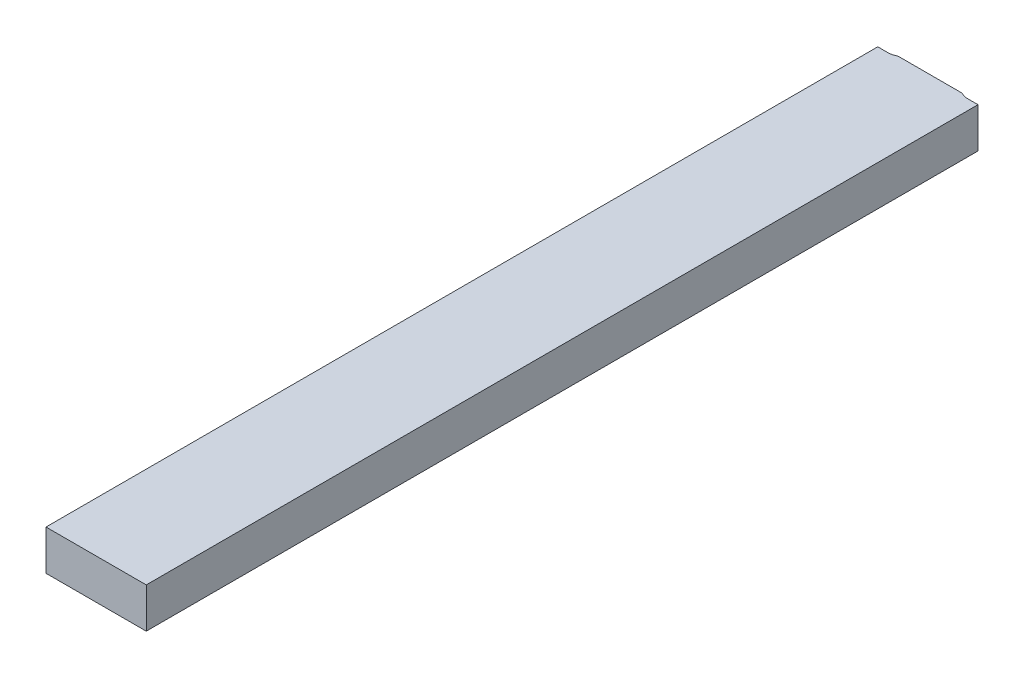
ISO-10303-21;
HEADER;
FILE_DESCRIPTION(('STEP AP214'),'2;1');
FILE_NAME('part.step','',(''),(''),'','','');
FILE_SCHEMA(('AUTOMOTIVE_DESIGN { 1 0 10303 214 1 1 1 1 }'));
ENDSEC;
DATA;
#1=APPLICATION_CONTEXT('core data for automotive mechanical design processes');
#2=APPLICATION_PROTOCOL_DEFINITION('international standard','automotive_design',2000,#1);
#3=PRODUCT_CONTEXT('',#1,'mechanical');
#4=PRODUCT('Part','Part','',(#3));
#5=PRODUCT_RELATED_PRODUCT_CATEGORY('part','',(#4));
#6=PRODUCT_DEFINITION_FORMATION('','',#4);
#7=PRODUCT_DEFINITION_CONTEXT('part definition',#1,'design');
#8=PRODUCT_DEFINITION('design','',#6,#7);
#9=PRODUCT_DEFINITION_SHAPE('','',#8);
#10=(LENGTH_UNIT() NAMED_UNIT(*) SI_UNIT(.MILLI.,.METRE.));
#11=(NAMED_UNIT(*) PLANE_ANGLE_UNIT() SI_UNIT($,.RADIAN.));
#12=(NAMED_UNIT(*) SI_UNIT($,.STERADIAN.) SOLID_ANGLE_UNIT());
#13=UNCERTAINTY_MEASURE_WITH_UNIT(LENGTH_MEASURE(1.E-05),#10,'distance_accuracy_value','');
#14=(GEOMETRIC_REPRESENTATION_CONTEXT(3) GLOBAL_UNCERTAINTY_ASSIGNED_CONTEXT((#13)) GLOBAL_UNIT_ASSIGNED_CONTEXT((#10,
#11,#12)) REPRESENTATION_CONTEXT('',''));
#15=CARTESIAN_POINT('',(0.,0.,0.));
#16=DIRECTION('',(0.,0.,1.));
#17=DIRECTION('',(1.,0.,0.));
#18=AXIS2_PLACEMENT_3D('',#15,#16,#17);
#19=CARTESIAN_POINT('',(-4.5,0.275,-4.982138483571));
#20=DIRECTION('',(0.,1.,0.));
#21=DIRECTION('',(0.,0.,1.));
#22=AXIS2_PLACEMENT_3D('',#19,#20,#21);
#23=PLANE('',#22);
#24=DIRECTION('',(1.,0.,0.));
#25=VECTOR('',#24,1.);
#26=CARTESIAN_POINT('',(-4.725,0.275,-7.051158663985));
#27=LINE('',#26,#25);
#28=CARTESIAN_POINT('',(-4.75,0.275,-7.051158663985));
#29=VERTEX_POINT('',#28);
#30=CARTESIAN_POINT('',(-4.69999999999826,0.275,-7.05115866398515));
#31=VERTEX_POINT('',#30);
#32=EDGE_CURVE('E184',#29,#31,#27,.T.);
#33=ORIENTED_EDGE('',*,*,#32,.T.);
#34=CARTESIAN_POINT('',(-4.66074390617903,0.275,-7.06145062487903));
#35=CARTESIAN_POINT('',(-4.66430562065387,0.275,-7.05943829430754));
#36=CARTESIAN_POINT('',(-4.66802308541288,0.275,-7.05770911016996));
#37=CARTESIAN_POINT('',(-4.67567866839801,0.275,-7.05483826908998));
#38=CARTESIAN_POINT('',(-4.67961678669287,0.275,-7.05369661233063));
#39=CARTESIAN_POINT('',(-4.68899940611309,0.275,-7.05173413514556));
#40=CARTESIAN_POINT('',(-4.6944962200161,0.275,-7.05115865434742));
#41=CARTESIAN_POINT('',(-4.69999999999652,0.275,-7.0511586639853));
#42=B_SPLINE_CURVE_WITH_KNOTS('',3,(#34,#35,#36,#37,#38,#39,#40,#41),.UNSPECIFIED.,.F.,.F.,(4,2,
2,4),(0.,0.0122542009828675,0.0245084057837986,0.0409766482847954),.UNSPECIFIED.);
#43=CARTESIAN_POINT('',(-4.66074390617903,0.275,-7.06145062487903));
#44=VERTEX_POINT('',#43);
#45=EDGE_CURVE('E93',#44,#31,#42,.T.);
#46=ORIENTED_EDGE('',*,*,#45,.F.);
#47=DIRECTION('',(1.,0.,0.));
#48=VECTOR('',#47,1.);
#49=CARTESIAN_POINT('',(-4.499999951796,0.275,-7.061450624879));
#50=LINE('',#49,#48);
#51=CARTESIAN_POINT('',(-4.339255997412,0.275,-7.06145062487899));
#52=VERTEX_POINT('',#51);
#53=EDGE_CURVE('E89',#44,#52,#50,.T.);
#54=ORIENTED_EDGE('',*,*,#53,.T.);
#55=CARTESIAN_POINT('',(-4.30000000000351,0.275,-7.05115866398509));
#56=CARTESIAN_POINT('',(-4.30408879277278,0.275,-7.05116284562048));
#57=CARTESIAN_POINT('',(-4.30817611333355,0.275,-7.05148113218099));
#58=CARTESIAN_POINT('',(-4.31625667415824,0.275,-7.05273057454798));
#59=CARTESIAN_POINT('',(-4.32024989952298,0.275,-7.05366182674584));
#60=CARTESIAN_POINT('',(-4.32939082766555,0.275,-7.05654480111922));
#61=CARTESIAN_POINT('',(-4.33446335028937,0.275,-7.05873731135742));
#62=CARTESIAN_POINT('',(-4.339255997412,0.275,-7.06145062487899));
#63=B_SPLINE_CURVE_WITH_KNOTS('',3,(#55,#56,#57,#58,#59,#60,#61,#62),.UNSPECIFIED.,.F.,.F.,(4,2,
2,4),(0.,0.0122527379750495,0.0245074032044925,0.0409759652394023),.UNSPECIFIED.);
#64=CARTESIAN_POINT('',(-4.30000000000175,0.275,-7.05115866398507));
#65=VERTEX_POINT('',#64);
#66=EDGE_CURVE('E21',#65,#52,#63,.T.);
#67=ORIENTED_EDGE('',*,*,#66,.F.);
#68=DIRECTION('',(1.,0.,0.));
#69=VECTOR('',#68,1.);
#70=CARTESIAN_POINT('',(-4.275,0.275,-7.051158663985));
#71=LINE('',#70,#69);
#72=CARTESIAN_POINT('',(-4.25,0.275,-7.051158663985));
#73=VERTEX_POINT('',#72);
#74=EDGE_CURVE('E84',#65,#73,#71,.T.);
#75=ORIENTED_EDGE('',*,*,#74,.T.);
#76=DIRECTION('',(0.,0.,-1.));
#77=VECTOR('',#76,1.);
#78=CARTESIAN_POINT('',(-4.25,0.275,-4.976992503125));
#79=LINE('',#78,#77);
#80=CARTESIAN_POINT('',(-4.25,0.275,-2.902826342264));
#81=VERTEX_POINT('',#80);
#82=EDGE_CURVE('E218',#81,#73,#79,.T.);
#83=ORIENTED_EDGE('',*,*,#82,.F.);
#84=DIRECTION('',(1.,0.,0.));
#85=VECTOR('',#84,1.);
#86=CARTESIAN_POINT('',(-4.5,0.275,-2.902826342264));
#87=LINE('',#86,#85);
#88=CARTESIAN_POINT('',(-4.75,0.275,-2.902826342264));
#89=VERTEX_POINT('',#88);
#90=EDGE_CURVE('E204',#89,#81,#87,.T.);
#91=ORIENTED_EDGE('',*,*,#90,.F.);
#92=DIRECTION('',(0.,0.,-1.));
#93=VECTOR('',#92,1.);
#94=CARTESIAN_POINT('',(-4.75,0.275,-4.976992503125));
#95=LINE('',#94,#93);
#96=EDGE_CURVE('E176',#89,#29,#95,.T.);
#97=ORIENTED_EDGE('',*,*,#96,.T.);
#98=EDGE_LOOP('',(#33,#46,#54,#67,#75,#83,#91,#97));
#99=FACE_BOUND('',#98,.T.);
#100=ADVANCED_FACE('F17',(#99),#23,.F.);
#101=CARTESIAN_POINT('',(-4.25,0.375,-4.976992503125));
#102=DIRECTION('',(1.,0.,0.));
#103=DIRECTION('',(0.,0.,-1.));
#104=AXIS2_PLACEMENT_3D('',#101,#102,#103);
#105=PLANE('',#104);
#106=DIRECTION('',(0.,0.,1.));
#107=VECTOR('',#106,1.);
#108=CARTESIAN_POINT('',(-4.25,0.475,-4.982138483571));
#109=LINE('',#108,#107);
#110=CARTESIAN_POINT('',(-4.25,0.475,-2.902826342264));
#111=VERTEX_POINT('',#110);
#112=CARTESIAN_POINT('',(-4.25,0.475,-7.051158663985));
#113=VERTEX_POINT('',#112);
#114=EDGE_CURVE('E189',#111,#113,#109,.F.);
#115=ORIENTED_EDGE('',*,*,#114,.F.);
#116=DIRECTION('',(0.,1.,0.));
#117=VECTOR('',#116,1.);
#118=CARTESIAN_POINT('',(-4.25,0.375,-2.902826342264));
#119=LINE('',#118,#117);
#120=EDGE_CURVE('E203',#81,#111,#119,.T.);
#121=ORIENTED_EDGE('',*,*,#120,.F.);
#122=ORIENTED_EDGE('',*,*,#82,.T.);
#123=DIRECTION('',(0.,1.,0.));
#124=VECTOR('',#123,1.);
#125=CARTESIAN_POINT('',(-4.25,0.375,-7.051158663985));
#126=LINE('',#125,#124);
#127=EDGE_CURVE('E233',#73,#113,#126,.T.);
#128=ORIENTED_EDGE('',*,*,#127,.T.);
#129=EDGE_LOOP('',(#115,#121,#122,#128));
#130=FACE_BOUND('',#129,.T.);
#131=ADVANCED_FACE('F238',(#130),#105,.T.);
#132=CARTESIAN_POINT('',(-4.275,0.375,-7.051158663985));
#133=DIRECTION('',(0.,0.,1.));
#134=DIRECTION('',(1.,0.,0.));
#135=AXIS2_PLACEMENT_3D('',#132,#133,#134);
#136=PLANE('',#135);
#137=DIRECTION('',(1.,0.,0.));
#138=VECTOR('',#137,1.);
#139=CARTESIAN_POINT('',(-4.5,0.475,-7.051158663985));
#140=LINE('',#139,#138);
#141=CARTESIAN_POINT('',(-4.30000007335933,0.475,-7.05115866418436));
#142=VERTEX_POINT('',#141);
#143=EDGE_CURVE('E135',#113,#142,#140,.F.);
#144=ORIENTED_EDGE('',*,*,#143,.F.);
#145=ORIENTED_EDGE('',*,*,#127,.F.);
#146=ORIENTED_EDGE('',*,*,#74,.F.);
#147=DIRECTION('',(0.,1.,0.));
#148=VECTOR('',#147,1.);
#149=CARTESIAN_POINT('',(-4.3,0.2699679840491,-7.05115866398508));
#150=LINE('',#149,#148);
#151=EDGE_CURVE('E103',#142,#65,#150,.F.);
#152=ORIENTED_EDGE('',*,*,#151,.F.);
#153=EDGE_LOOP('',(#144,#145,#146,#152));
#154=FACE_BOUND('',#153,.T.);
#155=ADVANCED_FACE('F125',(#154),#136,.F.);
#156=CARTESIAN_POINT('',(-4.29748039058,0.2699679840491,-7.051190309039));
#157=CARTESIAN_POINT('',(-4.29831958238,0.2699679840491,-7.051166943388));
#158=CARTESIAN_POINT('',(-4.304384997637,0.2699679840491,-7.051090682037));
#159=CARTESIAN_POINT('',(-4.315708586206,0.2699679840491,-7.052195104335));
#160=CARTESIAN_POINT('',(-4.328858649665,0.2699679840491,-7.056177217872));
#161=CARTESIAN_POINT('',(-4.337975877851,0.2699679840491,-7.060613467733));
#162=CARTESIAN_POINT('',(-4.342157497933,0.2699679840491,-7.063145821386));
#163=CARTESIAN_POINT('',(-4.343566222697,0.2699679840491,-7.064061090588));
#164=(BOUNDED_CURVE() B_SPLINE_CURVE(3,(#156,#157,#158,#159,#160,#161,#162,#163),.UNSPECIFIED.,
.F.,.F.) B_SPLINE_CURVE_WITH_KNOTS((4,1,1,1,1,4),(0.,0.05196482602246,0.3752098129395,
0.6983604955075,0.8962889073999,1.),
.UNSPECIFIED.) CURVE() GEOMETRIC_REPRESENTATION_ITEM() RATIONAL_B_SPLINE_CURVE((1.,1.,1.,1.,1.,
1.,1.,1.)) REPRESENTATION_ITEM(''));
#165=DIRECTION('',(0.,1.,0.));
#166=VECTOR('',#165,1.);
#167=SURFACE_OF_LINEAR_EXTRUSION('',#164,#166);
#168=ORIENTED_EDGE('',*,*,#66,.T.);
#169=DIRECTION('',(0.,1.,0.));
#170=VECTOR('',#169,1.);
#171=CARTESIAN_POINT('',(-4.339255997412,0.375,-7.061450624879));
#172=LINE('',#171,#170);
#173=CARTESIAN_POINT('',(-4.339255997412,0.475,-7.061450624879));
#174=VERTEX_POINT('',#173);
#175=EDGE_CURVE('E97',#52,#174,#172,.T.);
#176=ORIENTED_EDGE('',*,*,#175,.T.);
#177=CARTESIAN_POINT('',(-4.30000014671866,0.475,-7.05115866438369));
#178=CARTESIAN_POINT('',(-4.30408893948173,0.475,-7.0511628532203));
#179=CARTESIAN_POINT('',(-4.30817625948792,0.475,-7.05148114713333));
#180=CARTESIAN_POINT('',(-4.31625681806449,0.475,-7.05273060421157));
#181=CARTESIAN_POINT('',(-4.3202500417355,0.475,-7.05366186376829));
#182=CARTESIAN_POINT('',(-4.32939091806165,0.475,-7.05654484039364));
#183=CARTESIAN_POINT('',(-4.33446339307278,0.475,-7.05873733584115));
#184=CARTESIAN_POINT('',(-4.339255997412,0.475,-7.06145062487899));
#185=B_SPLINE_CURVE_WITH_KNOTS('',3,(#177,#178,#179,#180,#181,#182,#183,#184),.UNSPECIFIED.,.F.,
.F.,(4,2,2,4),(0.,0.0122527379884832,0.0245074032339859,0.0409758193004646),.UNSPECIFIED.);
#186=EDGE_CURVE('E129',#142,#174,#185,.T.);
#187=ORIENTED_EDGE('',*,*,#186,.F.);
#188=ORIENTED_EDGE('',*,*,#151,.T.);
#189=EDGE_LOOP('',(#168,#176,#187,#188));
#190=FACE_BOUND('',#189,.T.);
#191=ADVANCED_FACE('F100',(#190),#167,.T.);
#192=CARTESIAN_POINT('',(-4.499999951796,0.375,-7.061450624879));
#193=DIRECTION('',(0.,0.,1.));
#194=DIRECTION('',(1.,0.,0.));
#195=AXIS2_PLACEMENT_3D('',#192,#193,#194);
#196=PLANE('',#195);
#197=ORIENTED_EDGE('',*,*,#53,.F.);
#198=DIRECTION('',(0.,1.,0.));
#199=VECTOR('',#198,1.);
#200=CARTESIAN_POINT('',(-4.66074390617902,0.2699679840491,-7.06145062487904));
#201=LINE('',#200,#199);
#202=CARTESIAN_POINT('',(-4.66074390617902,0.475,-7.06145062487903));
#203=VERTEX_POINT('',#202);
#204=EDGE_CURVE('E109',#203,#44,#201,.F.);
#205=ORIENTED_EDGE('',*,*,#204,.F.);
#206=DIRECTION('',(1.,0.,0.));
#207=VECTOR('',#206,1.);
#208=CARTESIAN_POINT('',(-4.5,0.475,-7.061450624879));
#209=LINE('',#208,#207);
#210=EDGE_CURVE('E106',#174,#203,#209,.F.);
#211=ORIENTED_EDGE('',*,*,#210,.F.);
#212=ORIENTED_EDGE('',*,*,#175,.F.);
#213=EDGE_LOOP('',(#197,#205,#211,#212));
#214=FACE_BOUND('',#213,.T.);
#215=ADVANCED_FACE('F104',(#214),#196,.F.);
#216=CARTESIAN_POINT('',(-4.656433692458,0.2699679840491,-7.064061118802));
#217=CARTESIAN_POINT('',(-4.65784241379,0.2699679840491,-7.063145841608));
#218=CARTESIAN_POINT('',(-4.662021892669,0.2699679840491,-7.060614746012));
#219=CARTESIAN_POINT('',(-4.67113801512,0.2699679840491,-7.056178456814));
#220=CARTESIAN_POINT('',(-4.684287959398,0.2699679840491,-7.052195755785));
#221=CARTESIAN_POINT('',(-4.695613253729,0.2699679840491,-7.051090694486));
#222=CARTESIAN_POINT('',(-4.701678868218,0.2699679840491,-7.051166937919));
#223=CARTESIAN_POINT('',(-4.702517288364,0.2699679840491,-7.051190272618));
#224=(BOUNDED_CURVE() B_SPLINE_CURVE(3,(#216,#217,#218,#219,#220,#221,#222,#223),.UNSPECIFIED.,
.F.,.F.) B_SPLINE_CURVE_WITH_KNOTS((4,1,1,1,1,4),(0.,0.1037158878781,0.3014998794713,
0.6247605212749,0.9480806664175,1.),
.UNSPECIFIED.) CURVE() GEOMETRIC_REPRESENTATION_ITEM() RATIONAL_B_SPLINE_CURVE((1.,1.,1.,1.,1.,
1.,1.,1.)) REPRESENTATION_ITEM(''));
#225=DIRECTION('',(0.,1.,0.));
#226=VECTOR('',#225,1.);
#227=SURFACE_OF_LINEAR_EXTRUSION('',#224,#226);
#228=CARTESIAN_POINT('',(-4.66074390617903,0.475,-7.06145062487904));
#229=CARTESIAN_POINT('',(-4.66430562063098,0.475,-7.05943829433274));
#230=CARTESIAN_POINT('',(-4.66802308540143,0.475,-7.05770911018256));
#231=CARTESIAN_POINT('',(-4.67567866840944,0.475,-7.05483826907738));
#232=CARTESIAN_POINT('',(-4.67961678671575,0.475,-7.05369661230543));
#233=CARTESIAN_POINT('',(-4.68899935836829,0.475,-7.05173414515934));
#234=CARTESIAN_POINT('',(-4.69449612238526,0.475,-7.05115866469184));
#235=CARTESIAN_POINT('',(-4.69999985318857,0.475,-7.05115866438328));
#236=B_SPLINE_CURVE_WITH_KNOTS('',3,(#228,#229,#230,#231,#232,#233,#234,#235),.UNSPECIFIED.,.F.,
.F.,(4,2,2,4),(0.,0.0122542009828683,0.0245084057837985,0.0409765022206852),.UNSPECIFIED.);
#237=CARTESIAN_POINT('',(-4.7,0.475,-7.051158663985));
#238=VERTEX_POINT('',#237);
#239=EDGE_CURVE('E136',#203,#238,#236,.T.);
#240=ORIENTED_EDGE('',*,*,#239,.F.);
#241=ORIENTED_EDGE('',*,*,#204,.T.);
#242=ORIENTED_EDGE('',*,*,#45,.T.);
#243=DIRECTION('',(0.,1.,0.));
#244=VECTOR('',#243,1.);
#245=CARTESIAN_POINT('',(-4.7,0.375,-7.051158663985));
#246=LINE('',#245,#244);
#247=EDGE_CURVE('E182',#31,#238,#246,.T.);
#248=ORIENTED_EDGE('',*,*,#247,.T.);
#249=EDGE_LOOP('',(#240,#241,#242,#248));
#250=FACE_BOUND('',#249,.T.);
#251=ADVANCED_FACE('F159',(#250),#227,.T.);
#252=CARTESIAN_POINT('',(-4.725,0.375,-7.051158663985));
#253=DIRECTION('',(0.,0.,1.));
#254=DIRECTION('',(1.,0.,0.));
#255=AXIS2_PLACEMENT_3D('',#252,#253,#254);
#256=PLANE('',#255);
#257=DIRECTION('',(1.,0.,0.));
#258=VECTOR('',#257,1.);
#259=CARTESIAN_POINT('',(-4.5,0.475,-7.051158663985));
#260=LINE('',#259,#258);
#261=CARTESIAN_POINT('',(-4.75,0.475,-7.051158663985));
#262=VERTEX_POINT('',#261);
#263=EDGE_CURVE('E181',#238,#262,#260,.F.);
#264=ORIENTED_EDGE('',*,*,#263,.F.);
#265=ORIENTED_EDGE('',*,*,#247,.F.);
#266=ORIENTED_EDGE('',*,*,#32,.F.);
#267=DIRECTION('',(0.,1.,0.));
#268=VECTOR('',#267,1.);
#269=CARTESIAN_POINT('',(-4.75,0.375,-7.051158663985));
#270=LINE('',#269,#268);
#271=EDGE_CURVE('E174',#29,#262,#270,.T.);
#272=ORIENTED_EDGE('',*,*,#271,.T.);
#273=EDGE_LOOP('',(#264,#265,#266,#272));
#274=FACE_BOUND('',#273,.T.);
#275=ADVANCED_FACE('F157',(#274),#256,.F.);
#276=CARTESIAN_POINT('',(-4.75,0.375,-4.976992503125));
#277=DIRECTION('',(1.,0.,0.));
#278=DIRECTION('',(0.,0.,-1.));
#279=AXIS2_PLACEMENT_3D('',#276,#277,#278);
#280=PLANE('',#279);
#281=ORIENTED_EDGE('',*,*,#271,.F.);
#282=ORIENTED_EDGE('',*,*,#96,.F.);
#283=DIRECTION('',(0.,1.,0.));
#284=VECTOR('',#283,1.);
#285=CARTESIAN_POINT('',(-4.75,0.375,-2.902826342264));
#286=LINE('',#285,#284);
#287=CARTESIAN_POINT('',(-4.75,0.475,-2.902826342264));
#288=VERTEX_POINT('',#287);
#289=EDGE_CURVE('E40',#288,#89,#286,.F.);
#290=ORIENTED_EDGE('',*,*,#289,.F.);
#291=DIRECTION('',(0.,0.,1.));
#292=VECTOR('',#291,1.);
#293=CARTESIAN_POINT('',(-4.75,0.475,-4.982138483571));
#294=LINE('',#293,#292);
#295=EDGE_CURVE('E31',#262,#288,#294,.T.);
#296=ORIENTED_EDGE('',*,*,#295,.F.);
#297=EDGE_LOOP('',(#281,#282,#290,#296));
#298=FACE_BOUND('',#297,.T.);
#299=ADVANCED_FACE('F153',(#298),#280,.F.);
#300=CARTESIAN_POINT('',(-4.5,0.375,-2.902826342264));
#301=DIRECTION('',(0.,0.,1.));
#302=DIRECTION('',(1.,0.,0.));
#303=AXIS2_PLACEMENT_3D('',#300,#301,#302);
#304=PLANE('',#303);
#305=ORIENTED_EDGE('',*,*,#120,.T.);
#306=DIRECTION('',(1.,0.,0.));
#307=VECTOR('',#306,1.);
#308=CARTESIAN_POINT('',(-4.5,0.475,-2.902826342264));
#309=LINE('',#308,#307);
#310=EDGE_CURVE('E11',#288,#111,#309,.T.);
#311=ORIENTED_EDGE('',*,*,#310,.F.);
#312=ORIENTED_EDGE('',*,*,#289,.T.);
#313=ORIENTED_EDGE('',*,*,#90,.T.);
#314=EDGE_LOOP('',(#305,#311,#312,#313));
#315=FACE_BOUND('',#314,.T.);
#316=ADVANCED_FACE('F148',(#315),#304,.T.);
#317=CARTESIAN_POINT('',(-4.5,0.475,-4.982138483571));
#318=DIRECTION('',(0.,1.,0.));
#319=DIRECTION('',(0.,0.,1.));
#320=AXIS2_PLACEMENT_3D('',#317,#318,#319);
#321=PLANE('',#320);
#322=ORIENTED_EDGE('',*,*,#295,.T.);
#323=ORIENTED_EDGE('',*,*,#310,.T.);
#324=ORIENTED_EDGE('',*,*,#114,.T.);
#325=ORIENTED_EDGE('',*,*,#143,.T.);
#326=ORIENTED_EDGE('',*,*,#186,.T.);
#327=ORIENTED_EDGE('',*,*,#210,.T.);
#328=ORIENTED_EDGE('',*,*,#239,.T.);
#329=ORIENTED_EDGE('',*,*,#263,.T.);
#330=EDGE_LOOP('',(#322,#323,#324,#325,#326,#327,#328,#329));
#331=FACE_BOUND('',#330,.T.);
#332=ADVANCED_FACE('F144',(#331),#321,.T.);
#333=CLOSED_SHELL('',(#100,#131,#155,#191,#215,#251,#275,#299,#316,#332));
#334=MANIFOLD_SOLID_BREP('B1',#333);
#335=ADVANCED_BREP_SHAPE_REPRESENTATION('',(#18,#334),#14);
#336=SHAPE_DEFINITION_REPRESENTATION(#9,#335);
ENDSEC;
END-ISO-10303-21;
